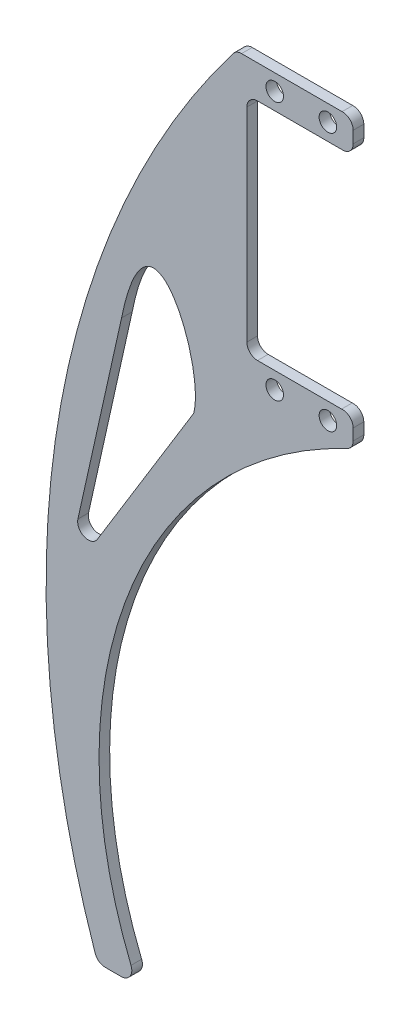
ISO-10303-21;
HEADER;
FILE_DESCRIPTION(('STEP AP214'),'2;1');
FILE_NAME('part.step','',(''),(''),'','','');
FILE_SCHEMA(('AUTOMOTIVE_DESIGN { 1 0 10303 214 1 1 1 1 }'));
ENDSEC;
DATA;
#1=APPLICATION_CONTEXT('core data for automotive mechanical design processes');
#2=APPLICATION_PROTOCOL_DEFINITION('international standard','automotive_design',2000,#1);
#3=PRODUCT_CONTEXT('',#1,'mechanical');
#4=PRODUCT('Part','Part','',(#3));
#5=PRODUCT_RELATED_PRODUCT_CATEGORY('part','',(#4));
#6=PRODUCT_DEFINITION_FORMATION('','',#4);
#7=PRODUCT_DEFINITION_CONTEXT('part definition',#1,'design');
#8=PRODUCT_DEFINITION('design','',#6,#7);
#9=PRODUCT_DEFINITION_SHAPE('','',#8);
#10=(LENGTH_UNIT() NAMED_UNIT(*) SI_UNIT(.MILLI.,.METRE.));
#11=(NAMED_UNIT(*) PLANE_ANGLE_UNIT() SI_UNIT($,.RADIAN.));
#12=(NAMED_UNIT(*) SI_UNIT($,.STERADIAN.) SOLID_ANGLE_UNIT());
#13=UNCERTAINTY_MEASURE_WITH_UNIT(LENGTH_MEASURE(1.E-05),#10,'distance_accuracy_value','');
#14=(GEOMETRIC_REPRESENTATION_CONTEXT(3) GLOBAL_UNCERTAINTY_ASSIGNED_CONTEXT((#13)) GLOBAL_UNIT_ASSIGNED_CONTEXT((#10,
#11,#12)) REPRESENTATION_CONTEXT('',''));
#15=CARTESIAN_POINT('',(0.,0.,0.));
#16=DIRECTION('',(0.,0.,1.));
#17=DIRECTION('',(1.,0.,0.));
#18=AXIS2_PLACEMENT_3D('',#15,#16,#17);
#19=CARTESIAN_POINT('',(46.0728826532933,111.207813928167,2.));
#20=DIRECTION('',(0.,0.,1.));
#21=DIRECTION('',(1.,0.,0.));
#22=AXIS2_PLACEMENT_3D('',#19,#20,#21);
#23=PLANE('',#22);
#24=CARTESIAN_POINT('',(33.3161966739368,110.03500000035,2.));
#25=DIRECTION('',(0.,0.,1.));
#26=DIRECTION('',(-1.,0.,0.));
#27=AXIS2_PLACEMENT_3D('',#24,#25,#26);
#28=CIRCLE('',#27,1.65);
#29=CARTESIAN_POINT('',(31.6661966739368,110.03500000035,2.));
#30=VERTEX_POINT('',#29);
#31=EDGE_CURVE('E681',#30,#30,#28,.T.);
#32=ORIENTED_EDGE('',*,*,#31,.F.);
#33=EDGE_LOOP('',(#32));
#34=FACE_BOUND('',#33,.T.);
#35=CARTESIAN_POINT('',(43.3161966739368,110.03500000035,2.));
#36=DIRECTION('',(0.,0.,1.));
#37=DIRECTION('',(-1.,0.,0.));
#38=AXIS2_PLACEMENT_3D('',#35,#36,#37);
#39=CIRCLE('',#38,1.65);
#40=CARTESIAN_POINT('',(41.6661966739368,110.03500000035,2.));
#41=VERTEX_POINT('',#40);
#42=EDGE_CURVE('E683',#41,#41,#39,.T.);
#43=ORIENTED_EDGE('',*,*,#42,.F.);
#44=EDGE_LOOP('',(#43));
#45=FACE_BOUND('',#44,.T.);
#46=CARTESIAN_POINT('',(33.3161966739368,158.66500000035,2.));
#47=DIRECTION('',(0.,0.,1.));
#48=DIRECTION('',(1.,0.,0.));
#49=AXIS2_PLACEMENT_3D('',#46,#47,#48);
#50=CIRCLE('',#49,1.65000000000001);
#51=CARTESIAN_POINT('',(34.9661966739368,158.66500000035,2.));
#52=VERTEX_POINT('',#51);
#53=EDGE_CURVE('E689',#52,#52,#50,.T.);
#54=ORIENTED_EDGE('',*,*,#53,.F.);
#55=EDGE_LOOP('',(#54));
#56=FACE_BOUND('',#55,.T.);
#57=CARTESIAN_POINT('',(43.3161966739368,158.66500000035,2.));
#58=DIRECTION('',(0.,0.,1.));
#59=DIRECTION('',(1.,0.,0.));
#60=AXIS2_PLACEMENT_3D('',#57,#58,#59);
#61=CIRCLE('',#60,1.65000000000001);
#62=CARTESIAN_POINT('',(44.9661966739368,158.66500000035,2.));
#63=VERTEX_POINT('',#62);
#64=EDGE_CURVE('E695',#63,#63,#61,.T.);
#65=ORIENTED_EDGE('',*,*,#64,.F.);
#66=EDGE_LOOP('',(#65));
#67=FACE_BOUND('',#66,.T.);
#68=CARTESIAN_POINT('',(46.0728826532933,111.207813928167,2.));
#69=DIRECTION('',(0.,0.,1.));
#70=DIRECTION('',(1.,0.,0.));
#71=AXIS2_PLACEMENT_3D('',#68,#69,#70);
#72=CIRCLE('',#71,1.99999999999999);
#73=CARTESIAN_POINT('',(48.0728826532933,111.207813928167,2.));
#74=VERTEX_POINT('',#73);
#75=CARTESIAN_POINT('',(45.8962625700651,113.20000000035,2.));
#76=VERTEX_POINT('',#75);
#77=EDGE_CURVE('E227',#74,#76,#72,.T.);
#78=ORIENTED_EDGE('',*,*,#77,.T.);
#79=DIRECTION('',(-1.,0.,0.));
#80=VECTOR('',#79,1.);
#81=CARTESIAN_POINT('',(30.0729105229966,113.20000000035,2.));
#82=LINE('',#81,#80);
#83=CARTESIAN_POINT('',(30.0729105229966,113.20000000035,2.));
#84=VERTEX_POINT('',#83);
#85=EDGE_CURVE('E230',#76,#84,#82,.T.);
#86=ORIENTED_EDGE('',*,*,#85,.T.);
#87=CARTESIAN_POINT('',(30.0729105229966,115.20000000035,2.));
#88=DIRECTION('',(0.,0.,-1.));
#89=DIRECTION('',(-1.,0.,0.));
#90=AXIS2_PLACEMENT_3D('',#87,#88,#89);
#91=CIRCLE('',#90,2.);
#92=CARTESIAN_POINT('',(28.0729105229966,115.20000000035,2.));
#93=VERTEX_POINT('',#92);
#94=EDGE_CURVE('E233',#84,#93,#91,.T.);
#95=ORIENTED_EDGE('',*,*,#94,.T.);
#96=DIRECTION('',(0.,1.,0.));
#97=VECTOR('',#96,1.);
#98=CARTESIAN_POINT('',(28.0729105229966,153.50000000035,2.));
#99=LINE('',#98,#97);
#100=CARTESIAN_POINT('',(28.0729105229966,153.50000000035,2.));
#101=VERTEX_POINT('',#100);
#102=EDGE_CURVE('E235',#93,#101,#99,.T.);
#103=ORIENTED_EDGE('',*,*,#102,.T.);
#104=CARTESIAN_POINT('',(30.0729105229966,153.50000000035,2.));
#105=DIRECTION('',(0.,0.,-1.));
#106=DIRECTION('',(-1.,0.,0.));
#107=AXIS2_PLACEMENT_3D('',#104,#105,#106);
#108=CIRCLE('',#107,2.);
#109=CARTESIAN_POINT('',(30.0729105229966,155.50000000035,2.));
#110=VERTEX_POINT('',#109);
#111=EDGE_CURVE('E237',#101,#110,#108,.T.);
#112=ORIENTED_EDGE('',*,*,#111,.T.);
#113=DIRECTION('',(1.,0.,0.));
#114=VECTOR('',#113,1.);
#115=CARTESIAN_POINT('',(46.20299442946,155.50000000035,2.));
#116=LINE('',#115,#114);
#117=CARTESIAN_POINT('',(46.20299442946,155.50000000035,2.));
#118=VERTEX_POINT('',#117);
#119=EDGE_CURVE('E239',#110,#118,#116,.T.);
#120=ORIENTED_EDGE('',*,*,#119,.T.);
#121=CARTESIAN_POINT('',(46.0728826532933,157.49576324425,2.));
#122=DIRECTION('',(0.,0.,1.));
#123=DIRECTION('',(1.,0.,0.));
#124=AXIS2_PLACEMENT_3D('',#121,#122,#123);
#125=CIRCLE('',#124,2.00000000000001);
#126=CARTESIAN_POINT('',(48.0728826532933,157.49576324425,2.));
#127=VERTEX_POINT('',#126);
#128=EDGE_CURVE('E241',#118,#127,#125,.T.);
#129=ORIENTED_EDGE('',*,*,#128,.T.);
#130=DIRECTION('',(0.,1.,0.));
#131=VECTOR('',#130,1.);
#132=CARTESIAN_POINT('',(48.0728826532933,159.708737403502,2.));
#133=LINE('',#132,#131);
#134=CARTESIAN_POINT('',(48.0728826532933,159.708737403502,2.));
#135=VERTEX_POINT('',#134);
#136=EDGE_CURVE('E243',#127,#135,#133,.T.);
#137=ORIENTED_EDGE('',*,*,#136,.T.);
#138=CARTESIAN_POINT('',(46.0728826532933,159.708737403502,2.));
#139=DIRECTION('',(0.,0.,1.));
#140=DIRECTION('',(1.,0.,0.));
#141=AXIS2_PLACEMENT_3D('',#138,#139,#140);
#142=CIRCLE('',#141,1.99999999999999);
#143=CARTESIAN_POINT('',(45.9834270137956,161.706735824063,2.));
#144=VERTEX_POINT('',#143);
#145=EDGE_CURVE('E245',#135,#144,#142,.T.);
#146=ORIENTED_EDGE('',*,*,#145,.T.);
#147=DIRECTION('',(-1.,0.,0.));
#148=VECTOR('',#147,1.);
#149=CARTESIAN_POINT('',(27.0734749749776,161.706735824063,2.));
#150=LINE('',#149,#148);
#151=CARTESIAN_POINT('',(27.0734749749776,161.706735824063,2.));
#152=VERTEX_POINT('',#151);
#153=EDGE_CURVE('E247',#144,#152,#150,.T.);
#154=ORIENTED_EDGE('',*,*,#153,.T.);
#155=CARTESIAN_POINT('',(27.0734749749776,159.706735824063,2.));
#156=DIRECTION('',(0.,0.,1.));
#157=DIRECTION('',(1.,0.,0.));
#158=AXIS2_PLACEMENT_3D('',#155,#156,#157);
#159=CIRCLE('',#158,2.);
#160=CARTESIAN_POINT('',(25.4838565858703,160.920454645294,2.));
#161=VERTEX_POINT('',#160);
#162=EDGE_CURVE('E249',#152,#161,#159,.T.);
#163=ORIENTED_EDGE('',*,*,#162,.T.);
#164=CARTESIAN_POINT('',(161.774008120262,56.8590502231599,2.));
#165=DIRECTION('',(0.,0.,1.));
#166=DIRECTION('',(-1.,0.,0.));
#167=AXIS2_PLACEMENT_3D('',#164,#165,#166);
#168=CIRCLE('',#167,171.475308122115);
#169=CARTESIAN_POINT('',(-0.469066984339945,1.35260126290927,2.));
#170=VERTEX_POINT('',#169);
#171=EDGE_CURVE('E251',#161,#170,#168,.T.);
#172=ORIENTED_EDGE('',*,*,#171,.T.);
#173=CARTESIAN_POINT('',(1.42325298733856,2.,2.));
#174=DIRECTION('',(0.,0.,1.));
#175=DIRECTION('',(-1.,0.,0.));
#176=AXIS2_PLACEMENT_3D('',#173,#174,#175);
#177=CIRCLE('',#176,2.);
#178=CARTESIAN_POINT('',(1.42325298733856,0.,2.));
#179=VERTEX_POINT('',#178);
#180=EDGE_CURVE('E253',#170,#179,#177,.T.);
#181=ORIENTED_EDGE('',*,*,#180,.T.);
#182=DIRECTION('',(1.,0.,0.));
#183=VECTOR('',#182,1.);
#184=CARTESIAN_POINT('',(1.42325298733856,0.,2.));
#185=LINE('',#184,#183);
#186=CARTESIAN_POINT('',(4.42325298733853,0.,2.));
#187=VERTEX_POINT('',#186);
#188=EDGE_CURVE('E255',#179,#187,#185,.T.);
#189=ORIENTED_EDGE('',*,*,#188,.T.);
#190=CARTESIAN_POINT('',(4.42325298733853,2.,2.));
#191=DIRECTION('',(0.,0.,1.));
#192=DIRECTION('',(1.,0.,0.));
#193=AXIS2_PLACEMENT_3D('',#190,#191,#192);
#194=CIRCLE('',#193,2.00000000000001);
#195=CARTESIAN_POINT('',(6.27586094666827,2.75355407837006,2.));
#196=VERTEX_POINT('',#195);
#197=EDGE_CURVE('E257',#187,#196,#194,.T.);
#198=ORIENTED_EDGE('',*,*,#197,.T.);
#199=CARTESIAN_POINT('',(81.8952477457775,33.5119760312431,2.));
#200=DIRECTION('',(0.,0.,-1.));
#201=DIRECTION('',(-1.,0.,0.));
#202=AXIS2_PLACEMENT_3D('',#199,#200,#201);
#203=CIRCLE('',#202,81.6356060852388);
#204=CARTESIAN_POINT('',(46.9295121863172,107.280326410591,2.));
#205=VERTEX_POINT('',#204);
#206=EDGE_CURVE('E259',#196,#205,#203,.T.);
#207=ORIENTED_EDGE('',*,*,#206,.T.);
#208=CARTESIAN_POINT('',(46.0728826532933,109.087585618107,2.));
#209=DIRECTION('',(0.,0.,1.));
#210=DIRECTION('',(-1.,0.,0.));
#211=AXIS2_PLACEMENT_3D('',#208,#209,#210);
#212=CIRCLE('',#211,1.99999999999999);
#213=CARTESIAN_POINT('',(48.0728826532933,109.087585618107,2.));
#214=VERTEX_POINT('',#213);
#215=EDGE_CURVE('E261',#205,#214,#212,.T.);
#216=ORIENTED_EDGE('',*,*,#215,.T.);
#217=DIRECTION('',(0.,1.,0.));
#218=VECTOR('',#217,1.);
#219=CARTESIAN_POINT('',(48.0728826532933,111.207813928167,2.));
#220=LINE('',#219,#218);
#221=EDGE_CURVE('E263',#214,#74,#220,.T.);
#222=ORIENTED_EDGE('',*,*,#221,.T.);
#223=EDGE_LOOP('',(#78,#86,#95,#103,#112,#120,#129,#137,#146,#154,#163,#172,#181,#189,#198,#207,
#216,#222));
#224=FACE_BOUND('',#223,.T.);
#225=DIRECTION('',(-0.217422621355332,-0.97607756030091,0.));
#226=VECTOR('',#225,1.);
#227=CARTESIAN_POINT('',(-3.71434564651079,70.4778184014568,2.));
#228=LINE('',#227,#226);
#229=CARTESIAN_POINT('',(4.49848581233704,107.347765252174,2.));
#230=VERTEX_POINT('',#229);
#231=CARTESIAN_POINT('',(-3.71434564651079,70.4778184014568,2.));
#232=VERTEX_POINT('',#231);
#233=EDGE_CURVE('E189',#230,#232,#228,.T.);
#234=ORIENTED_EDGE('',*,*,#233,.F.);
#235=CARTESIAN_POINT('',(18.0693585590063,98.5882623658266,2.));
#236=CARTESIAN_POINT('',(20.3769697194918,107.570049248518,2.));
#237=CARTESIAN_POINT('',(9.65057542004882,132.963079710802,2.));
#238=CARTESIAN_POINT('',(4.49848581233704,107.347765252174,2.));
#239=B_SPLINE_CURVE_WITH_KNOTS('',3,(#235,#236,#237,#238),.UNSPECIFIED.,.F.,.F.,(4,4),(0.,1.),.UNSPECIFIED.);
#240=CARTESIAN_POINT('',(18.0693585590063,98.5882623658266,2.));
#241=VERTEX_POINT('',#240);
#242=EDGE_CURVE('E181',#241,#230,#239,.T.);
#243=ORIENTED_EDGE('',*,*,#242,.F.);
#244=DIRECTION('',(0.522358565907549,0.852725939926193,0.));
#245=VECTOR('',#244,1.);
#246=CARTESIAN_POINT('',(-0.0567386460565808,68.9982560269311,2.));
#247=LINE('',#246,#245);
#248=CARTESIAN_POINT('',(-0.0567386460565839,68.9982560269311,2.));
#249=VERTEX_POINT('',#248);
#250=EDGE_CURVE('E203',#249,#241,#247,.T.);
#251=ORIENTED_EDGE('',*,*,#250,.F.);
#252=CARTESIAN_POINT('',(-1.76219052590897,70.0429731587462,2.));
#253=DIRECTION('',(0.,0.,1.));
#254=DIRECTION('',(1.,0.,0.));
#255=AXIS2_PLACEMENT_3D('',#252,#253,#254);
#256=CIRCLE('',#255,2.);
#257=EDGE_CURVE('E201',#232,#249,#256,.T.);
#258=ORIENTED_EDGE('',*,*,#257,.F.);
#259=EDGE_LOOP('',(#234,#243,#251,#258));
#260=FACE_BOUND('',#259,.T.);
#261=ADVANCED_FACE('F32',(#34,#45,#56,#67,#224,#260),#23,.T.);
#262=CARTESIAN_POINT('',(46.0728826532933,111.207813928167,0.));
#263=DIRECTION('',(0.,0.,1.));
#264=DIRECTION('',(1.,0.,0.));
#265=AXIS2_PLACEMENT_3D('',#262,#263,#264);
#266=PLANE('',#265);
#267=CARTESIAN_POINT('',(33.3161966739368,110.03500000035,0.));
#268=DIRECTION('',(0.,0.,1.));
#269=DIRECTION('',(-1.,0.,0.));
#270=AXIS2_PLACEMENT_3D('',#267,#268,#269);
#271=CIRCLE('',#270,1.65);
#272=CARTESIAN_POINT('',(31.6661966739368,110.03500000035,0.));
#273=VERTEX_POINT('',#272);
#274=EDGE_CURVE('E679',#273,#273,#271,.T.);
#275=ORIENTED_EDGE('',*,*,#274,.T.);
#276=EDGE_LOOP('',(#275));
#277=FACE_BOUND('',#276,.T.);
#278=CARTESIAN_POINT('',(43.3161966739368,110.03500000035,0.));
#279=DIRECTION('',(0.,0.,1.));
#280=DIRECTION('',(-1.,0.,0.));
#281=AXIS2_PLACEMENT_3D('',#278,#279,#280);
#282=CIRCLE('',#281,1.65);
#283=CARTESIAN_POINT('',(41.6661966739368,110.03500000035,0.));
#284=VERTEX_POINT('',#283);
#285=EDGE_CURVE('E686',#284,#284,#282,.T.);
#286=ORIENTED_EDGE('',*,*,#285,.T.);
#287=EDGE_LOOP('',(#286));
#288=FACE_BOUND('',#287,.T.);
#289=CARTESIAN_POINT('',(33.3161966739368,158.66500000035,0.));
#290=DIRECTION('',(0.,0.,1.));
#291=DIRECTION('',(1.,0.,0.));
#292=AXIS2_PLACEMENT_3D('',#289,#290,#291);
#293=CIRCLE('',#292,1.65000000000001);
#294=CARTESIAN_POINT('',(34.9661966739368,158.66500000035,0.));
#295=VERTEX_POINT('',#294);
#296=EDGE_CURVE('E692',#295,#295,#293,.T.);
#297=ORIENTED_EDGE('',*,*,#296,.T.);
#298=EDGE_LOOP('',(#297));
#299=FACE_BOUND('',#298,.T.);
#300=CARTESIAN_POINT('',(43.3161966739368,158.66500000035,0.));
#301=DIRECTION('',(0.,0.,1.));
#302=DIRECTION('',(1.,0.,0.));
#303=AXIS2_PLACEMENT_3D('',#300,#301,#302);
#304=CIRCLE('',#303,1.65000000000001);
#305=CARTESIAN_POINT('',(44.9661966739368,158.66500000035,0.));
#306=VERTEX_POINT('',#305);
#307=EDGE_CURVE('E214',#306,#306,#304,.T.);
#308=ORIENTED_EDGE('',*,*,#307,.T.);
#309=EDGE_LOOP('',(#308));
#310=FACE_BOUND('',#309,.T.);
#311=CARTESIAN_POINT('',(46.0728826532933,111.207813928167,0.));
#312=DIRECTION('',(0.,0.,1.));
#313=DIRECTION('',(1.,0.,0.));
#314=AXIS2_PLACEMENT_3D('',#311,#312,#313);
#315=CIRCLE('',#314,1.99999999999999);
#316=CARTESIAN_POINT('',(48.0728826532933,111.207813928167,0.));
#317=VERTEX_POINT('',#316);
#318=CARTESIAN_POINT('',(45.8962625700651,113.20000000035,0.));
#319=VERTEX_POINT('',#318);
#320=EDGE_CURVE('E197',#317,#319,#315,.T.);
#321=ORIENTED_EDGE('',*,*,#320,.F.);
#322=DIRECTION('',(0.,1.,0.));
#323=VECTOR('',#322,1.);
#324=CARTESIAN_POINT('',(48.0728826532933,111.207813928167,0.));
#325=LINE('',#324,#323);
#326=CARTESIAN_POINT('',(48.0728826532933,109.087585618107,0.));
#327=VERTEX_POINT('',#326);
#328=EDGE_CURVE('E231',#327,#317,#325,.T.);
#329=ORIENTED_EDGE('',*,*,#328,.F.);
#330=CARTESIAN_POINT('',(46.0728826532933,109.087585618107,0.));
#331=DIRECTION('',(0.,0.,1.));
#332=DIRECTION('',(-1.,0.,0.));
#333=AXIS2_PLACEMENT_3D('',#330,#331,#332);
#334=CIRCLE('',#333,1.99999999999999);
#335=CARTESIAN_POINT('',(46.9295121863172,107.280326410591,0.));
#336=VERTEX_POINT('',#335);
#337=EDGE_CURVE('E298',#336,#327,#334,.T.);
#338=ORIENTED_EDGE('',*,*,#337,.F.);
#339=CARTESIAN_POINT('',(81.8952477457775,33.5119760312431,0.));
#340=DIRECTION('',(0.,0.,-1.));
#341=DIRECTION('',(-1.,0.,0.));
#342=AXIS2_PLACEMENT_3D('',#339,#340,#341);
#343=CIRCLE('',#342,81.6356060852388);
#344=CARTESIAN_POINT('',(6.27586094666827,2.75355407837006,0.));
#345=VERTEX_POINT('',#344);
#346=EDGE_CURVE('E296',#345,#336,#343,.T.);
#347=ORIENTED_EDGE('',*,*,#346,.F.);
#348=CARTESIAN_POINT('',(4.42325298733853,2.,0.));
#349=DIRECTION('',(0.,0.,1.));
#350=DIRECTION('',(1.,0.,0.));
#351=AXIS2_PLACEMENT_3D('',#348,#349,#350);
#352=CIRCLE('',#351,2.00000000000001);
#353=CARTESIAN_POINT('',(4.42325298733853,0.,0.));
#354=VERTEX_POINT('',#353);
#355=EDGE_CURVE('E294',#354,#345,#352,.T.);
#356=ORIENTED_EDGE('',*,*,#355,.F.);
#357=DIRECTION('',(1.,0.,0.));
#358=VECTOR('',#357,1.);
#359=CARTESIAN_POINT('',(1.42325298733856,0.,0.));
#360=LINE('',#359,#358);
#361=CARTESIAN_POINT('',(1.42325298733856,0.,0.));
#362=VERTEX_POINT('',#361);
#363=EDGE_CURVE('E292',#362,#354,#360,.T.);
#364=ORIENTED_EDGE('',*,*,#363,.F.);
#365=CARTESIAN_POINT('',(1.42325298733856,2.,0.));
#366=DIRECTION('',(0.,0.,1.));
#367=DIRECTION('',(-1.,0.,0.));
#368=AXIS2_PLACEMENT_3D('',#365,#366,#367);
#369=CIRCLE('',#368,2.);
#370=CARTESIAN_POINT('',(-0.469066984339945,1.35260126290927,0.));
#371=VERTEX_POINT('',#370);
#372=EDGE_CURVE('E290',#371,#362,#369,.T.);
#373=ORIENTED_EDGE('',*,*,#372,.F.);
#374=CARTESIAN_POINT('',(161.774008120262,56.8590502231599,0.));
#375=DIRECTION('',(0.,0.,1.));
#376=DIRECTION('',(-1.,0.,0.));
#377=AXIS2_PLACEMENT_3D('',#374,#375,#376);
#378=CIRCLE('',#377,171.475308122115);
#379=CARTESIAN_POINT('',(25.4838565858703,160.920454645294,0.));
#380=VERTEX_POINT('',#379);
#381=EDGE_CURVE('E288',#380,#371,#378,.T.);
#382=ORIENTED_EDGE('',*,*,#381,.F.);
#383=CARTESIAN_POINT('',(27.0734749749776,159.706735824063,0.));
#384=DIRECTION('',(0.,0.,1.));
#385=DIRECTION('',(1.,0.,0.));
#386=AXIS2_PLACEMENT_3D('',#383,#384,#385);
#387=CIRCLE('',#386,2.);
#388=CARTESIAN_POINT('',(27.0734749749776,161.706735824063,0.));
#389=VERTEX_POINT('',#388);
#390=EDGE_CURVE('E286',#389,#380,#387,.T.);
#391=ORIENTED_EDGE('',*,*,#390,.F.);
#392=DIRECTION('',(-1.,0.,0.));
#393=VECTOR('',#392,1.);
#394=CARTESIAN_POINT('',(27.0734749749776,161.706735824063,0.));
#395=LINE('',#394,#393);
#396=CARTESIAN_POINT('',(45.9834270137956,161.706735824063,0.));
#397=VERTEX_POINT('',#396);
#398=EDGE_CURVE('E284',#397,#389,#395,.T.);
#399=ORIENTED_EDGE('',*,*,#398,.F.);
#400=CARTESIAN_POINT('',(46.0728826532933,159.708737403502,0.));
#401=DIRECTION('',(0.,0.,1.));
#402=DIRECTION('',(1.,0.,0.));
#403=AXIS2_PLACEMENT_3D('',#400,#401,#402);
#404=CIRCLE('',#403,1.99999999999999);
#405=CARTESIAN_POINT('',(48.0728826532933,159.708737403502,0.));
#406=VERTEX_POINT('',#405);
#407=EDGE_CURVE('E282',#406,#397,#404,.T.);
#408=ORIENTED_EDGE('',*,*,#407,.F.);
#409=DIRECTION('',(0.,1.,0.));
#410=VECTOR('',#409,1.);
#411=CARTESIAN_POINT('',(48.0728826532933,159.708737403502,0.));
#412=LINE('',#411,#410);
#413=CARTESIAN_POINT('',(48.0728826532933,157.49576324425,0.));
#414=VERTEX_POINT('',#413);
#415=EDGE_CURVE('E280',#414,#406,#412,.T.);
#416=ORIENTED_EDGE('',*,*,#415,.F.);
#417=CARTESIAN_POINT('',(46.0728826532933,157.49576324425,0.));
#418=DIRECTION('',(0.,0.,1.));
#419=DIRECTION('',(1.,0.,0.));
#420=AXIS2_PLACEMENT_3D('',#417,#418,#419);
#421=CIRCLE('',#420,2.00000000000001);
#422=CARTESIAN_POINT('',(46.20299442946,155.50000000035,0.));
#423=VERTEX_POINT('',#422);
#424=EDGE_CURVE('E278',#423,#414,#421,.T.);
#425=ORIENTED_EDGE('',*,*,#424,.F.);
#426=DIRECTION('',(1.,0.,0.));
#427=VECTOR('',#426,1.);
#428=CARTESIAN_POINT('',(46.20299442946,155.50000000035,0.));
#429=LINE('',#428,#427);
#430=CARTESIAN_POINT('',(30.0729105229966,155.50000000035,0.));
#431=VERTEX_POINT('',#430);
#432=EDGE_CURVE('E276',#431,#423,#429,.T.);
#433=ORIENTED_EDGE('',*,*,#432,.F.);
#434=CARTESIAN_POINT('',(30.0729105229966,153.50000000035,0.));
#435=DIRECTION('',(0.,0.,-1.));
#436=DIRECTION('',(-1.,0.,0.));
#437=AXIS2_PLACEMENT_3D('',#434,#435,#436);
#438=CIRCLE('',#437,2.);
#439=CARTESIAN_POINT('',(28.0729105229966,153.50000000035,0.));
#440=VERTEX_POINT('',#439);
#441=EDGE_CURVE('E274',#440,#431,#438,.T.);
#442=ORIENTED_EDGE('',*,*,#441,.F.);
#443=DIRECTION('',(0.,1.,0.));
#444=VECTOR('',#443,1.);
#445=CARTESIAN_POINT('',(28.0729105229966,153.50000000035,0.));
#446=LINE('',#445,#444);
#447=CARTESIAN_POINT('',(28.0729105229966,115.20000000035,0.));
#448=VERTEX_POINT('',#447);
#449=EDGE_CURVE('E272',#448,#440,#446,.T.);
#450=ORIENTED_EDGE('',*,*,#449,.F.);
#451=CARTESIAN_POINT('',(30.0729105229966,115.20000000035,0.));
#452=DIRECTION('',(0.,0.,-1.));
#453=DIRECTION('',(-1.,0.,0.));
#454=AXIS2_PLACEMENT_3D('',#451,#452,#453);
#455=CIRCLE('',#454,2.);
#456=CARTESIAN_POINT('',(30.0729105229966,113.20000000035,0.));
#457=VERTEX_POINT('',#456);
#458=EDGE_CURVE('E270',#457,#448,#455,.T.);
#459=ORIENTED_EDGE('',*,*,#458,.F.);
#460=DIRECTION('',(-1.,0.,0.));
#461=VECTOR('',#460,1.);
#462=CARTESIAN_POINT('',(30.0729105229966,113.20000000035,0.));
#463=LINE('',#462,#461);
#464=EDGE_CURVE('E268',#319,#457,#463,.T.);
#465=ORIENTED_EDGE('',*,*,#464,.F.);
#466=EDGE_LOOP('',(#321,#329,#338,#347,#356,#364,#373,#382,#391,#399,#408,#416,#425,#433,#442,
#450,#459,#465));
#467=FACE_BOUND('',#466,.T.);
#468=CARTESIAN_POINT('',(18.0693585590063,98.5882623658266,0.));
#469=CARTESIAN_POINT('',(20.3769697194918,107.570049248518,0.));
#470=CARTESIAN_POINT('',(9.65057542004882,132.963079710802,0.));
#471=CARTESIAN_POINT('',(4.49848581233704,107.347765252174,0.));
#472=B_SPLINE_CURVE_WITH_KNOTS('',3,(#468,#469,#470,#471),.UNSPECIFIED.,.F.,.F.,(4,4),(0.,1.),.UNSPECIFIED.);
#473=CARTESIAN_POINT('',(18.0693585590063,98.5882623658266,0.));
#474=VERTEX_POINT('',#473);
#475=CARTESIAN_POINT('',(4.49848581233704,107.347765252174,0.));
#476=VERTEX_POINT('',#475);
#477=EDGE_CURVE('E55',#474,#476,#472,.T.);
#478=ORIENTED_EDGE('',*,*,#477,.T.);
#479=DIRECTION('',(-0.217422621355332,-0.97607756030091,0.));
#480=VECTOR('',#479,1.);
#481=CARTESIAN_POINT('',(-3.71434564651079,70.4778184014568,0.));
#482=LINE('',#481,#480);
#483=CARTESIAN_POINT('',(-3.71434564651079,70.4778184014568,0.));
#484=VERTEX_POINT('',#483);
#485=EDGE_CURVE('E196',#476,#484,#482,.T.);
#486=ORIENTED_EDGE('',*,*,#485,.T.);
#487=CARTESIAN_POINT('',(-1.76219052590897,70.0429731587462,0.));
#488=DIRECTION('',(0.,0.,1.));
#489=DIRECTION('',(1.,0.,0.));
#490=AXIS2_PLACEMENT_3D('',#487,#488,#489);
#491=CIRCLE('',#490,2.);
#492=CARTESIAN_POINT('',(-0.0567386460565862,68.9982560269311,0.));
#493=VERTEX_POINT('',#492);
#494=EDGE_CURVE('E219',#484,#493,#491,.T.);
#495=ORIENTED_EDGE('',*,*,#494,.T.);
#496=DIRECTION('',(0.522358565907549,0.852725939926193,0.));
#497=VECTOR('',#496,1.);
#498=CARTESIAN_POINT('',(-0.0567386460565808,68.9982560269311,0.));
#499=LINE('',#498,#497);
#500=EDGE_CURVE('E190',#493,#474,#499,.T.);
#501=ORIENTED_EDGE('',*,*,#500,.T.);
#502=EDGE_LOOP('',(#478,#486,#495,#501));
#503=FACE_BOUND('',#502,.T.);
#504=ADVANCED_FACE('F358',(#277,#288,#299,#310,#467,#503),#266,.F.);
#505=CARTESIAN_POINT('',(46.0728826532933,111.207813928167,2.));
#506=DIRECTION('',(0.,0.,-1.));
#507=DIRECTION('',(-1.,0.,0.));
#508=AXIS2_PLACEMENT_3D('',#505,#506,#507);
#509=CYLINDRICAL_SURFACE('',#508,1.99999999999999);
#510=ORIENTED_EDGE('',*,*,#320,.T.);
#511=DIRECTION('',(0.,0.,-1.));
#512=VECTOR('',#511,1.);
#513=CARTESIAN_POINT('',(45.8962625700651,113.20000000035,2.));
#514=LINE('',#513,#512);
#515=EDGE_CURVE('E11',#76,#319,#514,.T.);
#516=ORIENTED_EDGE('',*,*,#515,.F.);
#517=ORIENTED_EDGE('',*,*,#77,.F.);
#518=DIRECTION('',(0.,0.,-1.));
#519=VECTOR('',#518,1.);
#520=CARTESIAN_POINT('',(48.0728826532933,111.207813928167,2.));
#521=LINE('',#520,#519);
#522=EDGE_CURVE('E265',#74,#317,#521,.T.);
#523=ORIENTED_EDGE('',*,*,#522,.T.);
#524=EDGE_LOOP('',(#510,#516,#517,#523));
#525=FACE_BOUND('',#524,.T.);
#526=ADVANCED_FACE('F34',(#525),#509,.T.);
#527=CARTESIAN_POINT('',(30.0729105229966,113.20000000035,2.));
#528=DIRECTION('',(0.,-1.,0.));
#529=DIRECTION('',(0.,0.,-1.));
#530=AXIS2_PLACEMENT_3D('',#527,#528,#529);
#531=PLANE('',#530);
#532=ORIENTED_EDGE('',*,*,#464,.T.);
#533=DIRECTION('',(0.,0.,-1.));
#534=VECTOR('',#533,1.);
#535=CARTESIAN_POINT('',(30.0729105229966,113.20000000035,2.));
#536=LINE('',#535,#534);
#537=EDGE_CURVE('E40',#84,#457,#536,.T.);
#538=ORIENTED_EDGE('',*,*,#537,.F.);
#539=ORIENTED_EDGE('',*,*,#85,.F.);
#540=ORIENTED_EDGE('',*,*,#515,.T.);
#541=EDGE_LOOP('',(#532,#538,#539,#540));
#542=FACE_BOUND('',#541,.T.);
#543=ADVANCED_FACE('F375',(#542),#531,.F.);
#544=CARTESIAN_POINT('',(30.0729105229966,115.20000000035,2.));
#545=DIRECTION('',(0.,0.,-1.));
#546=DIRECTION('',(-1.,0.,0.));
#547=AXIS2_PLACEMENT_3D('',#544,#545,#546);
#548=CYLINDRICAL_SURFACE('',#547,2.);
#549=ORIENTED_EDGE('',*,*,#458,.T.);
#550=DIRECTION('',(0.,0.,-1.));
#551=VECTOR('',#550,1.);
#552=CARTESIAN_POINT('',(28.0729105229966,115.20000000035,2.));
#553=LINE('',#552,#551);
#554=EDGE_CURVE('E345',#93,#448,#553,.T.);
#555=ORIENTED_EDGE('',*,*,#554,.F.);
#556=ORIENTED_EDGE('',*,*,#94,.F.);
#557=ORIENTED_EDGE('',*,*,#537,.T.);
#558=EDGE_LOOP('',(#549,#555,#556,#557));
#559=FACE_BOUND('',#558,.T.);
#560=ADVANCED_FACE('F352',(#559),#548,.F.);
#561=CARTESIAN_POINT('',(28.0729105229966,153.50000000035,2.));
#562=DIRECTION('',(-1.,0.,0.));
#563=DIRECTION('',(0.,-1.,0.));
#564=AXIS2_PLACEMENT_3D('',#561,#562,#563);
#565=PLANE('',#564);
#566=ORIENTED_EDGE('',*,*,#449,.T.);
#567=DIRECTION('',(0.,0.,-1.));
#568=VECTOR('',#567,1.);
#569=CARTESIAN_POINT('',(28.0729105229966,153.50000000035,2.));
#570=LINE('',#569,#568);
#571=EDGE_CURVE('E342',#101,#440,#570,.T.);
#572=ORIENTED_EDGE('',*,*,#571,.F.);
#573=ORIENTED_EDGE('',*,*,#102,.F.);
#574=ORIENTED_EDGE('',*,*,#554,.T.);
#575=EDGE_LOOP('',(#566,#572,#573,#574));
#576=FACE_BOUND('',#575,.T.);
#577=ADVANCED_FACE('F364',(#576),#565,.F.);
#578=CARTESIAN_POINT('',(30.0729105229966,153.50000000035,2.));
#579=DIRECTION('',(0.,0.,-1.));
#580=DIRECTION('',(-1.,0.,0.));
#581=AXIS2_PLACEMENT_3D('',#578,#579,#580);
#582=CYLINDRICAL_SURFACE('',#581,2.);
#583=ORIENTED_EDGE('',*,*,#441,.T.);
#584=DIRECTION('',(0.,0.,-1.));
#585=VECTOR('',#584,1.);
#586=CARTESIAN_POINT('',(30.0729105229966,155.50000000035,2.));
#587=LINE('',#586,#585);
#588=EDGE_CURVE('E339',#110,#431,#587,.T.);
#589=ORIENTED_EDGE('',*,*,#588,.F.);
#590=ORIENTED_EDGE('',*,*,#111,.F.);
#591=ORIENTED_EDGE('',*,*,#571,.T.);
#592=EDGE_LOOP('',(#583,#589,#590,#591));
#593=FACE_BOUND('',#592,.T.);
#594=ADVANCED_FACE('F368',(#593),#582,.F.);
#595=CARTESIAN_POINT('',(46.20299442946,155.50000000035,2.));
#596=DIRECTION('',(0.,1.,0.));
#597=DIRECTION('',(0.,0.,1.));
#598=AXIS2_PLACEMENT_3D('',#595,#596,#597);
#599=PLANE('',#598);
#600=ORIENTED_EDGE('',*,*,#432,.T.);
#601=DIRECTION('',(0.,0.,-1.));
#602=VECTOR('',#601,1.);
#603=CARTESIAN_POINT('',(46.20299442946,155.50000000035,2.));
#604=LINE('',#603,#602);
#605=EDGE_CURVE('E336',#118,#423,#604,.T.);
#606=ORIENTED_EDGE('',*,*,#605,.F.);
#607=ORIENTED_EDGE('',*,*,#119,.F.);
#608=ORIENTED_EDGE('',*,*,#588,.T.);
#609=EDGE_LOOP('',(#600,#606,#607,#608));
#610=FACE_BOUND('',#609,.T.);
#611=ADVANCED_FACE('F438',(#610),#599,.F.);
#612=CARTESIAN_POINT('',(46.0728826532933,157.49576324425,2.));
#613=DIRECTION('',(0.,0.,-1.));
#614=DIRECTION('',(-1.,0.,0.));
#615=AXIS2_PLACEMENT_3D('',#612,#613,#614);
#616=CYLINDRICAL_SURFACE('',#615,2.00000000000001);
#617=ORIENTED_EDGE('',*,*,#424,.T.);
#618=DIRECTION('',(0.,0.,-1.));
#619=VECTOR('',#618,1.);
#620=CARTESIAN_POINT('',(48.0728826532933,157.49576324425,2.));
#621=LINE('',#620,#619);
#622=EDGE_CURVE('E333',#127,#414,#621,.T.);
#623=ORIENTED_EDGE('',*,*,#622,.F.);
#624=ORIENTED_EDGE('',*,*,#128,.F.);
#625=ORIENTED_EDGE('',*,*,#605,.T.);
#626=EDGE_LOOP('',(#617,#623,#624,#625));
#627=FACE_BOUND('',#626,.T.);
#628=ADVANCED_FACE('F436',(#627),#616,.T.);
#629=CARTESIAN_POINT('',(48.0728826532933,159.708737403502,2.));
#630=DIRECTION('',(-1.,0.,0.));
#631=DIRECTION('',(0.,-1.,0.));
#632=AXIS2_PLACEMENT_3D('',#629,#630,#631);
#633=PLANE('',#632);
#634=ORIENTED_EDGE('',*,*,#415,.T.);
#635=DIRECTION('',(0.,0.,-1.));
#636=VECTOR('',#635,1.);
#637=CARTESIAN_POINT('',(48.0728826532933,159.708737403502,2.));
#638=LINE('',#637,#636);
#639=EDGE_CURVE('E330',#135,#406,#638,.T.);
#640=ORIENTED_EDGE('',*,*,#639,.F.);
#641=ORIENTED_EDGE('',*,*,#136,.F.);
#642=ORIENTED_EDGE('',*,*,#622,.T.);
#643=EDGE_LOOP('',(#634,#640,#641,#642));
#644=FACE_BOUND('',#643,.T.);
#645=ADVANCED_FACE('F432',(#644),#633,.F.);
#646=CARTESIAN_POINT('',(46.0728826532933,159.708737403502,2.));
#647=DIRECTION('',(0.,0.,-1.));
#648=DIRECTION('',(-1.,0.,0.));
#649=AXIS2_PLACEMENT_3D('',#646,#647,#648);
#650=CYLINDRICAL_SURFACE('',#649,1.99999999999999);
#651=ORIENTED_EDGE('',*,*,#407,.T.);
#652=DIRECTION('',(0.,0.,-1.));
#653=VECTOR('',#652,1.);
#654=CARTESIAN_POINT('',(45.9834270137956,161.706735824063,2.));
#655=LINE('',#654,#653);
#656=EDGE_CURVE('E327',#144,#397,#655,.T.);
#657=ORIENTED_EDGE('',*,*,#656,.F.);
#658=ORIENTED_EDGE('',*,*,#145,.F.);
#659=ORIENTED_EDGE('',*,*,#639,.T.);
#660=EDGE_LOOP('',(#651,#657,#658,#659));
#661=FACE_BOUND('',#660,.T.);
#662=ADVANCED_FACE('F427',(#661),#650,.T.);
#663=CARTESIAN_POINT('',(27.0734749749776,161.706735824063,2.));
#664=DIRECTION('',(0.,-1.,0.));
#665=DIRECTION('',(0.,0.,-1.));
#666=AXIS2_PLACEMENT_3D('',#663,#664,#665);
#667=PLANE('',#666);
#668=ORIENTED_EDGE('',*,*,#398,.T.);
#669=DIRECTION('',(0.,0.,-1.));
#670=VECTOR('',#669,1.);
#671=CARTESIAN_POINT('',(27.0734749749776,161.706735824063,2.));
#672=LINE('',#671,#670);
#673=EDGE_CURVE('E324',#152,#389,#672,.T.);
#674=ORIENTED_EDGE('',*,*,#673,.F.);
#675=ORIENTED_EDGE('',*,*,#153,.F.);
#676=ORIENTED_EDGE('',*,*,#656,.T.);
#677=EDGE_LOOP('',(#668,#674,#675,#676));
#678=FACE_BOUND('',#677,.T.);
#679=ADVANCED_FACE('F421',(#678),#667,.F.);
#680=CARTESIAN_POINT('',(27.0734749749776,159.706735824063,2.));
#681=DIRECTION('',(0.,0.,-1.));
#682=DIRECTION('',(-1.,0.,0.));
#683=AXIS2_PLACEMENT_3D('',#680,#681,#682);
#684=CYLINDRICAL_SURFACE('',#683,2.);
#685=ORIENTED_EDGE('',*,*,#390,.T.);
#686=DIRECTION('',(0.,0.,-1.));
#687=VECTOR('',#686,1.);
#688=CARTESIAN_POINT('',(25.4838565858703,160.920454645294,2.));
#689=LINE('',#688,#687);
#690=EDGE_CURVE('E321',#161,#380,#689,.T.);
#691=ORIENTED_EDGE('',*,*,#690,.F.);
#692=ORIENTED_EDGE('',*,*,#162,.F.);
#693=ORIENTED_EDGE('',*,*,#673,.T.);
#694=EDGE_LOOP('',(#685,#691,#692,#693));
#695=FACE_BOUND('',#694,.T.);
#696=ADVANCED_FACE('F417',(#695),#684,.T.);
#697=CARTESIAN_POINT('',(161.774008120262,56.8590502231599,2.));
#698=DIRECTION('',(0.,0.,-1.));
#699=DIRECTION('',(-1.,0.,0.));
#700=AXIS2_PLACEMENT_3D('',#697,#698,#699);
#701=CYLINDRICAL_SURFACE('',#700,171.475308122115);
#702=ORIENTED_EDGE('',*,*,#381,.T.);
#703=DIRECTION('',(0.,0.,-1.));
#704=VECTOR('',#703,1.);
#705=CARTESIAN_POINT('',(-0.469066984339945,1.35260126290927,2.));
#706=LINE('',#705,#704);
#707=EDGE_CURVE('E318',#170,#371,#706,.T.);
#708=ORIENTED_EDGE('',*,*,#707,.F.);
#709=ORIENTED_EDGE('',*,*,#171,.F.);
#710=ORIENTED_EDGE('',*,*,#690,.T.);
#711=EDGE_LOOP('',(#702,#708,#709,#710));
#712=FACE_BOUND('',#711,.T.);
#713=ADVANCED_FACE('F412',(#712),#701,.T.);
#714=CARTESIAN_POINT('',(1.42325298733856,2.,2.));
#715=DIRECTION('',(0.,0.,-1.));
#716=DIRECTION('',(-1.,0.,0.));
#717=AXIS2_PLACEMENT_3D('',#714,#715,#716);
#718=CYLINDRICAL_SURFACE('',#717,2.);
#719=ORIENTED_EDGE('',*,*,#372,.T.);
#720=DIRECTION('',(0.,0.,-1.));
#721=VECTOR('',#720,1.);
#722=CARTESIAN_POINT('',(1.42325298733856,0.,2.));
#723=LINE('',#722,#721);
#724=EDGE_CURVE('E315',#179,#362,#723,.T.);
#725=ORIENTED_EDGE('',*,*,#724,.F.);
#726=ORIENTED_EDGE('',*,*,#180,.F.);
#727=ORIENTED_EDGE('',*,*,#707,.T.);
#728=EDGE_LOOP('',(#719,#725,#726,#727));
#729=FACE_BOUND('',#728,.T.);
#730=ADVANCED_FACE('F406',(#729),#718,.T.);
#731=CARTESIAN_POINT('',(1.42325298733856,0.,2.));
#732=DIRECTION('',(0.,1.,0.));
#733=DIRECTION('',(0.,0.,1.));
#734=AXIS2_PLACEMENT_3D('',#731,#732,#733);
#735=PLANE('',#734);
#736=ORIENTED_EDGE('',*,*,#363,.T.);
#737=DIRECTION('',(0.,0.,-1.));
#738=VECTOR('',#737,1.);
#739=CARTESIAN_POINT('',(4.42325298733853,0.,2.));
#740=LINE('',#739,#738);
#741=EDGE_CURVE('E312',#187,#354,#740,.T.);
#742=ORIENTED_EDGE('',*,*,#741,.F.);
#743=ORIENTED_EDGE('',*,*,#188,.F.);
#744=ORIENTED_EDGE('',*,*,#724,.T.);
#745=EDGE_LOOP('',(#736,#742,#743,#744));
#746=FACE_BOUND('',#745,.T.);
#747=ADVANCED_FACE('F402',(#746),#735,.F.);
#748=CARTESIAN_POINT('',(4.42325298733853,2.,2.));
#749=DIRECTION('',(0.,0.,-1.));
#750=DIRECTION('',(-1.,0.,0.));
#751=AXIS2_PLACEMENT_3D('',#748,#749,#750);
#752=CYLINDRICAL_SURFACE('',#751,2.00000000000001);
#753=ORIENTED_EDGE('',*,*,#355,.T.);
#754=DIRECTION('',(0.,0.,-1.));
#755=VECTOR('',#754,1.);
#756=CARTESIAN_POINT('',(6.27586094666827,2.75355407837006,2.));
#757=LINE('',#756,#755);
#758=EDGE_CURVE('E309',#196,#345,#757,.T.);
#759=ORIENTED_EDGE('',*,*,#758,.F.);
#760=ORIENTED_EDGE('',*,*,#197,.F.);
#761=ORIENTED_EDGE('',*,*,#741,.T.);
#762=EDGE_LOOP('',(#753,#759,#760,#761));
#763=FACE_BOUND('',#762,.T.);
#764=ADVANCED_FACE('F397',(#763),#752,.T.);
#765=CARTESIAN_POINT('',(81.8952477457775,33.5119760312431,2.));
#766=DIRECTION('',(0.,0.,-1.));
#767=DIRECTION('',(-1.,0.,0.));
#768=AXIS2_PLACEMENT_3D('',#765,#766,#767);
#769=CYLINDRICAL_SURFACE('',#768,81.6356060852388);
#770=ORIENTED_EDGE('',*,*,#346,.T.);
#771=DIRECTION('',(0.,0.,-1.));
#772=VECTOR('',#771,1.);
#773=CARTESIAN_POINT('',(46.9295121863172,107.280326410591,2.));
#774=LINE('',#773,#772);
#775=EDGE_CURVE('E306',#205,#336,#774,.T.);
#776=ORIENTED_EDGE('',*,*,#775,.F.);
#777=ORIENTED_EDGE('',*,*,#206,.F.);
#778=ORIENTED_EDGE('',*,*,#758,.T.);
#779=EDGE_LOOP('',(#770,#776,#777,#778));
#780=FACE_BOUND('',#779,.T.);
#781=ADVANCED_FACE('F391',(#780),#769,.F.);
#782=CARTESIAN_POINT('',(46.0728826532933,109.087585618107,2.));
#783=DIRECTION('',(0.,0.,-1.));
#784=DIRECTION('',(-1.,0.,0.));
#785=AXIS2_PLACEMENT_3D('',#782,#783,#784);
#786=CYLINDRICAL_SURFACE('',#785,1.99999999999999);
#787=ORIENTED_EDGE('',*,*,#337,.T.);
#788=DIRECTION('',(0.,0.,-1.));
#789=VECTOR('',#788,1.);
#790=CARTESIAN_POINT('',(48.0728826532933,109.087585618107,2.));
#791=LINE('',#790,#789);
#792=EDGE_CURVE('E303',#214,#327,#791,.T.);
#793=ORIENTED_EDGE('',*,*,#792,.F.);
#794=ORIENTED_EDGE('',*,*,#215,.F.);
#795=ORIENTED_EDGE('',*,*,#775,.T.);
#796=EDGE_LOOP('',(#787,#793,#794,#795));
#797=FACE_BOUND('',#796,.T.);
#798=ADVANCED_FACE('F387',(#797),#786,.T.);
#799=CARTESIAN_POINT('',(48.0728826532933,111.207813928167,2.));
#800=DIRECTION('',(-1.,0.,0.));
#801=DIRECTION('',(0.,0.,1.));
#802=AXIS2_PLACEMENT_3D('',#799,#800,#801);
#803=PLANE('',#802);
#804=ORIENTED_EDGE('',*,*,#328,.T.);
#805=ORIENTED_EDGE('',*,*,#522,.F.);
#806=ORIENTED_EDGE('',*,*,#221,.F.);
#807=ORIENTED_EDGE('',*,*,#792,.T.);
#808=EDGE_LOOP('',(#804,#805,#806,#807));
#809=FACE_BOUND('',#808,.T.);
#810=ADVANCED_FACE('F382',(#809),#803,.F.);
#811=DIRECTION('',(0.,0.,-1.));
#812=VECTOR('',#811,1.);
#813=SURFACE_OF_LINEAR_EXTRUSION('',#239,#812);
#814=ORIENTED_EDGE('',*,*,#477,.F.);
#815=DIRECTION('',(0.,0.,-1.));
#816=VECTOR('',#815,1.);
#817=CARTESIAN_POINT('',(18.0693585590063,98.5882623658266,2.));
#818=LINE('',#817,#816);
#819=EDGE_CURVE('E185',#241,#474,#818,.T.);
#820=ORIENTED_EDGE('',*,*,#819,.F.);
#821=ORIENTED_EDGE('',*,*,#242,.T.);
#822=DIRECTION('',(0.,0.,-1.));
#823=VECTOR('',#822,1.);
#824=CARTESIAN_POINT('',(4.49848581233704,107.347765252174,2.));
#825=LINE('',#824,#823);
#826=EDGE_CURVE('E184',#230,#476,#825,.T.);
#827=ORIENTED_EDGE('',*,*,#826,.T.);
#828=EDGE_LOOP('',(#814,#820,#821,#827));
#829=FACE_BOUND('',#828,.T.);
#830=ADVANCED_FACE('F183',(#829),#813,.T.);
#831=CARTESIAN_POINT('',(-3.71434564651079,70.4778184014568,2.));
#832=DIRECTION('',(0.97607756030091,-0.217422621355332,0.));
#833=DIRECTION('',(0.217422621355332,0.97607756030091,0.));
#834=AXIS2_PLACEMENT_3D('',#831,#832,#833);
#835=PLANE('',#834);
#836=ORIENTED_EDGE('',*,*,#485,.F.);
#837=ORIENTED_EDGE('',*,*,#826,.F.);
#838=ORIENTED_EDGE('',*,*,#233,.T.);
#839=DIRECTION('',(0.,0.,-1.));
#840=VECTOR('',#839,1.);
#841=CARTESIAN_POINT('',(-3.71434564651079,70.4778184014568,2.));
#842=LINE('',#841,#840);
#843=EDGE_CURVE('E198',#232,#484,#842,.T.);
#844=ORIENTED_EDGE('',*,*,#843,.T.);
#845=EDGE_LOOP('',(#836,#837,#838,#844));
#846=FACE_BOUND('',#845,.T.);
#847=ADVANCED_FACE('F193',(#846),#835,.T.);
#848=CARTESIAN_POINT('',(-1.76219052590897,70.0429731587462,2.));
#849=DIRECTION('',(0.,0.,-1.));
#850=DIRECTION('',(-1.,0.,0.));
#851=AXIS2_PLACEMENT_3D('',#848,#849,#850);
#852=CYLINDRICAL_SURFACE('',#851,2.);
#853=ORIENTED_EDGE('',*,*,#494,.F.);
#854=ORIENTED_EDGE('',*,*,#843,.F.);
#855=ORIENTED_EDGE('',*,*,#257,.T.);
#856=DIRECTION('',(0.,0.,-1.));
#857=VECTOR('',#856,1.);
#858=CARTESIAN_POINT('',(-0.0567386460565862,68.9982560269311,2.));
#859=LINE('',#858,#857);
#860=EDGE_CURVE('E47',#249,#493,#859,.T.);
#861=ORIENTED_EDGE('',*,*,#860,.T.);
#862=EDGE_LOOP('',(#853,#854,#855,#861));
#863=FACE_BOUND('',#862,.T.);
#864=ADVANCED_FACE('F536',(#863),#852,.F.);
#865=CARTESIAN_POINT('',(-0.0567386460565808,68.9982560269311,2.));
#866=DIRECTION('',(-0.852725939926193,0.522358565907549,0.));
#867=DIRECTION('',(-0.522358565907549,-0.852725939926193,0.));
#868=AXIS2_PLACEMENT_3D('',#865,#866,#867);
#869=PLANE('',#868);
#870=ORIENTED_EDGE('',*,*,#500,.F.);
#871=ORIENTED_EDGE('',*,*,#860,.F.);
#872=ORIENTED_EDGE('',*,*,#250,.T.);
#873=ORIENTED_EDGE('',*,*,#819,.T.);
#874=EDGE_LOOP('',(#870,#871,#872,#873));
#875=FACE_BOUND('',#874,.T.);
#876=ADVANCED_FACE('F542',(#875),#869,.T.);
#877=CARTESIAN_POINT('',(43.3161966739368,158.66500000035,0.));
#878=DIRECTION('',(0.,0.,1.));
#879=DIRECTION('',(1.,0.,0.));
#880=AXIS2_PLACEMENT_3D('',#877,#878,#879);
#881=CYLINDRICAL_SURFACE('',#880,1.65000000000001);
#882=ORIENTED_EDGE('',*,*,#307,.F.);
#883=EDGE_LOOP('',(#882));
#884=FACE_BOUND('',#883,.T.);
#885=ORIENTED_EDGE('',*,*,#64,.T.);
#886=EDGE_LOOP('',(#885));
#887=FACE_BOUND('',#886,.T.);
#888=ADVANCED_FACE('F550',(#884,#887),#881,.F.);
#889=CARTESIAN_POINT('',(33.3161966739368,158.66500000035,0.));
#890=DIRECTION('',(0.,0.,1.));
#891=DIRECTION('',(1.,0.,0.));
#892=AXIS2_PLACEMENT_3D('',#889,#890,#891);
#893=CYLINDRICAL_SURFACE('',#892,1.65000000000001);
#894=ORIENTED_EDGE('',*,*,#296,.F.);
#895=EDGE_LOOP('',(#894));
#896=FACE_BOUND('',#895,.T.);
#897=ORIENTED_EDGE('',*,*,#53,.T.);
#898=EDGE_LOOP('',(#897));
#899=FACE_BOUND('',#898,.T.);
#900=ADVANCED_FACE('F557',(#896,#899),#893,.F.);
#901=CARTESIAN_POINT('',(43.3161966739368,110.03500000035,0.));
#902=DIRECTION('',(0.,0.,1.));
#903=DIRECTION('',(1.,0.,0.));
#904=AXIS2_PLACEMENT_3D('',#901,#902,#903);
#905=CYLINDRICAL_SURFACE('',#904,1.65);
#906=ORIENTED_EDGE('',*,*,#285,.F.);
#907=EDGE_LOOP('',(#906));
#908=FACE_BOUND('',#907,.T.);
#909=ORIENTED_EDGE('',*,*,#42,.T.);
#910=EDGE_LOOP('',(#909));
#911=FACE_BOUND('',#910,.T.);
#912=ADVANCED_FACE('F566',(#908,#911),#905,.F.);
#913=CARTESIAN_POINT('',(33.3161966739368,110.03500000035,0.));
#914=DIRECTION('',(0.,0.,1.));
#915=DIRECTION('',(1.,0.,0.));
#916=AXIS2_PLACEMENT_3D('',#913,#914,#915);
#917=CYLINDRICAL_SURFACE('',#916,1.65);
#918=ORIENTED_EDGE('',*,*,#274,.F.);
#919=EDGE_LOOP('',(#918));
#920=FACE_BOUND('',#919,.T.);
#921=ORIENTED_EDGE('',*,*,#31,.T.);
#922=EDGE_LOOP('',(#921));
#923=FACE_BOUND('',#922,.T.);
#924=ADVANCED_FACE('F574',(#920,#923),#917,.F.);
#925=CLOSED_SHELL('',(#261,#504,#526,#543,#560,#577,#594,#611,#628,#645,#662,#679,#696,#713,
#730,#747,#764,#781,#798,#810,#830,#847,#864,#876,#888,#900,#912,#924));
#926=MANIFOLD_SOLID_BREP('B2',#925);
#927=ADVANCED_BREP_SHAPE_REPRESENTATION('',(#18,#926),#14);
#928=SHAPE_DEFINITION_REPRESENTATION(#9,#927);
ENDSEC;
END-ISO-10303-21;
